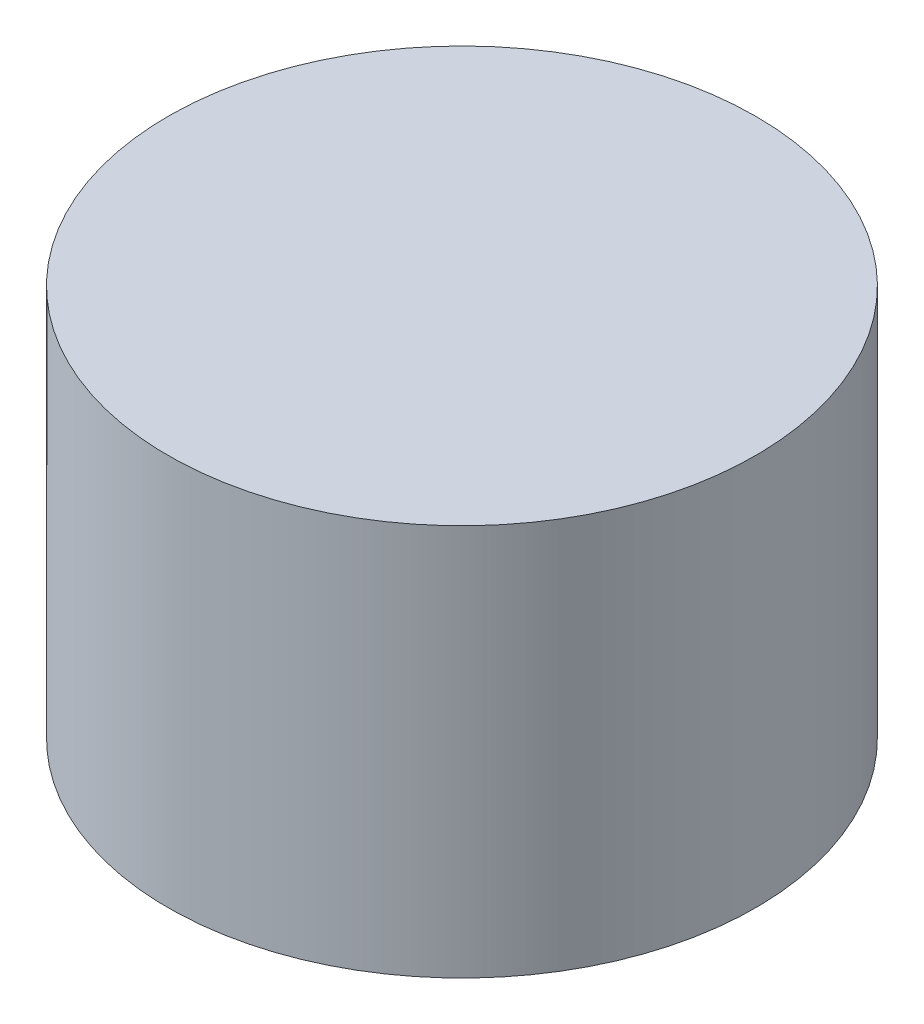
ISO-10303-21;
HEADER;
FILE_DESCRIPTION(('STEP AP214'),'2;1');
FILE_NAME('part.step','',(''),(''),'','','');
FILE_SCHEMA(('AUTOMOTIVE_DESIGN { 1 0 10303 214 1 1 1 1 }'));
ENDSEC;
DATA;
#1=APPLICATION_CONTEXT('core data for automotive mechanical design processes');
#2=APPLICATION_PROTOCOL_DEFINITION('international standard','automotive_design',2000,#1);
#3=PRODUCT_CONTEXT('',#1,'mechanical');
#4=PRODUCT('Part','Part','',(#3));
#5=PRODUCT_RELATED_PRODUCT_CATEGORY('part','',(#4));
#6=PRODUCT_DEFINITION_FORMATION('','',#4);
#7=PRODUCT_DEFINITION_CONTEXT('part definition',#1,'design');
#8=PRODUCT_DEFINITION('design','',#6,#7);
#9=PRODUCT_DEFINITION_SHAPE('','',#8);
#10=(LENGTH_UNIT() NAMED_UNIT(*) SI_UNIT(.MILLI.,.METRE.));
#11=(NAMED_UNIT(*) PLANE_ANGLE_UNIT() SI_UNIT($,.RADIAN.));
#12=(NAMED_UNIT(*) SI_UNIT($,.STERADIAN.) SOLID_ANGLE_UNIT());
#13=UNCERTAINTY_MEASURE_WITH_UNIT(LENGTH_MEASURE(1.E-05),#10,'distance_accuracy_value','');
#14=(GEOMETRIC_REPRESENTATION_CONTEXT(3) GLOBAL_UNCERTAINTY_ASSIGNED_CONTEXT((#13)) GLOBAL_UNIT_ASSIGNED_CONTEXT((#10,
#11,#12)) REPRESENTATION_CONTEXT('',''));
#15=CARTESIAN_POINT('',(0.,0.,0.));
#16=DIRECTION('',(0.,0.,1.));
#17=DIRECTION('',(1.,0.,0.));
#18=AXIS2_PLACEMENT_3D('',#15,#16,#17);
#19=CARTESIAN_POINT('',(0.,200.,0.));
#20=DIRECTION('',(0.,1.,0.));
#21=DIRECTION('',(0.,0.,1.));
#22=AXIS2_PLACEMENT_3D('',#19,#20,#21);
#23=PLANE('',#22);
#24=CARTESIAN_POINT('',(0.,200.,0.));
#25=DIRECTION('',(0.,-1.,0.));
#26=DIRECTION('',(0.,0.,-1.));
#27=AXIS2_PLACEMENT_3D('',#24,#25,#26);
#28=CIRCLE('',#27,150.);
#29=CARTESIAN_POINT('',(0.,200.,-150.));
#30=VERTEX_POINT('',#29);
#31=EDGE_CURVE('E10',#30,#30,#28,.T.);
#32=ORIENTED_EDGE('',*,*,#31,.F.);
#33=EDGE_LOOP('',(#32));
#34=FACE_BOUND('',#33,.T.);
#35=ADVANCED_FACE('F33',(#34),#23,.T.);
#36=CARTESIAN_POINT('',(0.,0.,0.));
#37=DIRECTION('',(0.,-1.,0.));
#38=DIRECTION('',(0.,0.,-1.));
#39=AXIS2_PLACEMENT_3D('',#36,#37,#38);
#40=CYLINDRICAL_SURFACE('',#39,150.);
#41=ORIENTED_EDGE('',*,*,#31,.T.);
#42=EDGE_LOOP('',(#41));
#43=FACE_BOUND('',#42,.T.);
#44=CARTESIAN_POINT('',(0.,0.,0.));
#45=DIRECTION('',(0.,-1.,0.));
#46=DIRECTION('',(0.,0.,-1.));
#47=AXIS2_PLACEMENT_3D('',#44,#45,#46);
#48=CIRCLE('',#47,150.);
#49=CARTESIAN_POINT('',(0.,0.,-150.));
#50=VERTEX_POINT('',#49);
#51=EDGE_CURVE('E39',#50,#50,#48,.T.);
#52=ORIENTED_EDGE('',*,*,#51,.F.);
#53=EDGE_LOOP('',(#52));
#54=FACE_BOUND('',#53,.T.);
#55=ADVANCED_FACE('F47',(#43,#54),#40,.T.);
#56=CARTESIAN_POINT('',(150.,0.,0.));
#57=DIRECTION('',(0.,-1.,0.));
#58=DIRECTION('',(0.,0.,-1.));
#59=AXIS2_PLACEMENT_3D('',#56,#57,#58);
#60=PLANE('',#59);
#61=ORIENTED_EDGE('',*,*,#51,.T.);
#62=EDGE_LOOP('',(#61));
#63=FACE_BOUND('',#62,.T.);
#64=ADVANCED_FACE('F45',(#63),#60,.T.);
#65=CLOSED_SHELL('',(#35,#55,#64));
#66=MANIFOLD_SOLID_BREP('B2',#65);
#67=ADVANCED_BREP_SHAPE_REPRESENTATION('',(#18,#66),#14);
#68=SHAPE_DEFINITION_REPRESENTATION(#9,#67);
ENDSEC;
END-ISO-10303-21;
